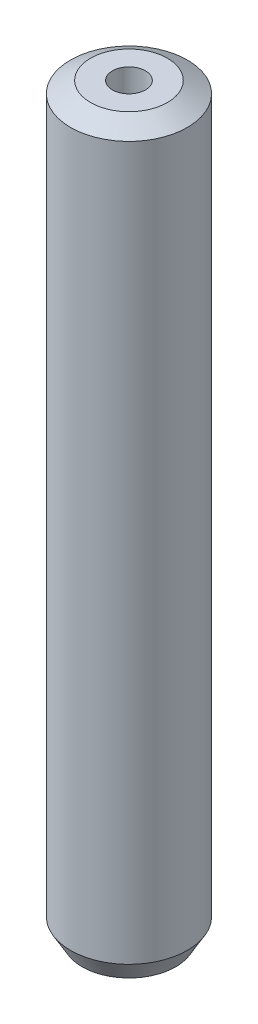
ISO-10303-21;
HEADER;
FILE_DESCRIPTION(('STEP AP214'),'2;1');
FILE_NAME('part.step','',(''),(''),'','','');
FILE_SCHEMA(('AUTOMOTIVE_DESIGN { 1 0 10303 214 1 1 1 1 }'));
ENDSEC;
DATA;
#1=APPLICATION_CONTEXT('core data for automotive mechanical design processes');
#2=APPLICATION_PROTOCOL_DEFINITION('international standard','automotive_design',2000,#1);
#3=PRODUCT_CONTEXT('',#1,'mechanical');
#4=PRODUCT('Part','Part','',(#3));
#5=PRODUCT_RELATED_PRODUCT_CATEGORY('part','',(#4));
#6=PRODUCT_DEFINITION_FORMATION('','',#4);
#7=PRODUCT_DEFINITION_CONTEXT('part definition',#1,'design');
#8=PRODUCT_DEFINITION('design','',#6,#7);
#9=PRODUCT_DEFINITION_SHAPE('','',#8);
#10=(LENGTH_UNIT() NAMED_UNIT(*) SI_UNIT(.MILLI.,.METRE.));
#11=(NAMED_UNIT(*) PLANE_ANGLE_UNIT() SI_UNIT($,.RADIAN.));
#12=(NAMED_UNIT(*) SI_UNIT($,.STERADIAN.) SOLID_ANGLE_UNIT());
#13=UNCERTAINTY_MEASURE_WITH_UNIT(LENGTH_MEASURE(1.E-05),#10,'distance_accuracy_value','');
#14=(GEOMETRIC_REPRESENTATION_CONTEXT(3) GLOBAL_UNCERTAINTY_ASSIGNED_CONTEXT((#13)) GLOBAL_UNIT_ASSIGNED_CONTEXT((#10,
#11,#12)) REPRESENTATION_CONTEXT('',''));
#15=CARTESIAN_POINT('',(0.,0.,0.));
#16=DIRECTION('',(0.,0.,1.));
#17=DIRECTION('',(1.,0.,0.));
#18=AXIS2_PLACEMENT_3D('',#15,#16,#17);
#19=CARTESIAN_POINT('',(0.,191.043298849846,0.));
#20=DIRECTION('',(0.,-1.,0.));
#21=DIRECTION('',(0.,0.,-1.));
#22=AXIS2_PLACEMENT_3D('',#19,#20,#21);
#23=CYLINDRICAL_SURFACE('',#22,15.);
#24=CARTESIAN_POINT('',(0.,188.077368706955,0.));
#25=DIRECTION('',(0.,1.,0.));
#26=DIRECTION('',(0.,0.,1.));
#27=AXIS2_PLACEMENT_3D('',#24,#25,#26);
#28=CIRCLE('',#27,15.);
#29=CARTESIAN_POINT('',(0.,188.077368706955,15.));
#30=VERTEX_POINT('',#29);
#31=EDGE_CURVE('E50',#30,#30,#28,.F.);
#32=ORIENTED_EDGE('',*,*,#31,.T.);
#33=EDGE_LOOP('',(#32));
#34=FACE_BOUND('',#33,.T.);
#35=CARTESIAN_POINT('',(0.,5.13714169918664,0.));
#36=DIRECTION('',(0.,1.,0.));
#37=DIRECTION('',(0.,0.,1.));
#38=AXIS2_PLACEMENT_3D('',#35,#36,#37);
#39=CIRCLE('',#38,15.);
#40=CARTESIAN_POINT('',(0.,5.13714169918664,15.));
#41=VERTEX_POINT('',#40);
#42=EDGE_CURVE('E51',#41,#41,#39,.T.);
#43=ORIENTED_EDGE('',*,*,#42,.T.);
#44=EDGE_LOOP('',(#43));
#45=FACE_BOUND('',#44,.T.);
#46=ADVANCED_FACE('F39',(#34,#45),#23,.T.);
#47=CARTESIAN_POINT('',(0.,191.043298849846,0.));
#48=DIRECTION('',(0.,1.,0.));
#49=DIRECTION('',(0.,0.,1.));
#50=AXIS2_PLACEMENT_3D('',#47,#48,#49);
#51=PLANE('',#50);
#52=CARTESIAN_POINT('',(0.,191.043298849846,0.));
#53=DIRECTION('',(0.,1.,0.));
#54=DIRECTION('',(0.,0.,1.));
#55=AXIS2_PLACEMENT_3D('',#52,#53,#54);
#56=CIRCLE('',#55,9.8628583008133);
#57=CARTESIAN_POINT('',(0.,191.043298849846,9.8628583008133));
#58=VERTEX_POINT('',#57);
#59=EDGE_CURVE('E54',#58,#58,#56,.T.);
#60=ORIENTED_EDGE('',*,*,#59,.T.);
#61=EDGE_LOOP('',(#60));
#62=FACE_BOUND('',#61,.T.);
#63=CARTESIAN_POINT('',(0.,191.043298849846,0.));
#64=DIRECTION('',(0.,1.,0.));
#65=DIRECTION('',(0.,0.,1.));
#66=AXIS2_PLACEMENT_3D('',#63,#64,#65);
#67=CIRCLE('',#66,4.24581836870262);
#68=CARTESIAN_POINT('',(0.,191.043298849846,4.24581836870262));
#69=VERTEX_POINT('',#68);
#70=EDGE_CURVE('E58',#69,#69,#67,.T.);
#71=ORIENTED_EDGE('',*,*,#70,.F.);
#72=EDGE_LOOP('',(#71));
#73=FACE_BOUND('',#72,.T.);
#74=ADVANCED_FACE('F69',(#62,#73),#51,.T.);
#75=CARTESIAN_POINT('',(0.,0.,0.));
#76=DIRECTION('',(0.,1.,0.));
#77=DIRECTION('',(0.,0.,1.));
#78=AXIS2_PLACEMENT_3D('',#75,#76,#77);
#79=PLANE('',#78);
#80=CARTESIAN_POINT('',(0.,0.,0.));
#81=DIRECTION('',(0.,1.,0.));
#82=DIRECTION('',(0.,0.,1.));
#83=AXIS2_PLACEMENT_3D('',#80,#81,#82);
#84=CIRCLE('',#83,12.0340698571093);
#85=CARTESIAN_POINT('',(0.,0.,12.0340698571093));
#86=VERTEX_POINT('',#85);
#87=EDGE_CURVE('E10',#86,#86,#84,.F.);
#88=ORIENTED_EDGE('',*,*,#87,.T.);
#89=EDGE_LOOP('',(#88));
#90=FACE_BOUND('',#89,.T.);
#91=CARTESIAN_POINT('',(0.,0.,0.));
#92=DIRECTION('',(0.,1.,0.));
#93=DIRECTION('',(0.,0.,1.));
#94=AXIS2_PLACEMENT_3D('',#91,#92,#93);
#95=CIRCLE('',#94,4.24581836870262);
#96=CARTESIAN_POINT('',(0.,0.,4.24581836870262));
#97=VERTEX_POINT('',#96);
#98=EDGE_CURVE('E63',#97,#97,#95,.T.);
#99=ORIENTED_EDGE('',*,*,#98,.T.);
#100=EDGE_LOOP('',(#99));
#101=FACE_BOUND('',#100,.T.);
#102=ADVANCED_FACE('F75',(#90,#101),#79,.F.);
#103=CARTESIAN_POINT('',(0.,191.043298849846,0.));
#104=DIRECTION('',(0.,-1.,0.));
#105=DIRECTION('',(0.,0.,-1.));
#106=AXIS2_PLACEMENT_3D('',#103,#104,#105);
#107=CYLINDRICAL_SURFACE('',#106,4.24581836870262);
#108=ORIENTED_EDGE('',*,*,#70,.T.);
#109=EDGE_LOOP('',(#108));
#110=FACE_BOUND('',#109,.T.);
#111=ORIENTED_EDGE('',*,*,#98,.F.);
#112=EDGE_LOOP('',(#111));
#113=FACE_BOUND('',#112,.T.);
#114=ADVANCED_FACE('F70',(#110,#113),#107,.F.);
#115=CARTESIAN_POINT('',(0.,191.043298849846,0.));
#116=DIRECTION('',(0.,-1.,0.));
#117=DIRECTION('',(0.,0.,-1.));
#118=AXIS2_PLACEMENT_3D('',#115,#116,#117);
#119=CONICAL_SURFACE('',#118,9.8628583008133,1.0471975511966);
#120=ORIENTED_EDGE('',*,*,#31,.F.);
#121=EDGE_LOOP('',(#120));
#122=FACE_BOUND('',#121,.T.);
#123=ORIENTED_EDGE('',*,*,#59,.F.);
#124=EDGE_LOOP('',(#123));
#125=FACE_BOUND('',#124,.T.);
#126=ADVANCED_FACE('F81',(#122,#125),#119,.T.);
#127=CARTESIAN_POINT('',(0.,5.13714169918664,0.));
#128=DIRECTION('',(0.,1.,0.));
#129=DIRECTION('',(0.,0.,1.));
#130=AXIS2_PLACEMENT_3D('',#127,#128,#129);
#131=CONICAL_SURFACE('',#130,15.,0.523598775598302);
#132=CARTESIAN_POINT('',(0.,0.,12.0340698571093));
#133=CARTESIAN_POINT('',(0.,0.0535118926998599,12.0649649627644));
#134=CARTESIAN_POINT('',(0.,0.107023785399721,12.0958600684195));
#135=CARTESIAN_POINT('',(0.,0.214047570799442,12.1576502797298));
#136=CARTESIAN_POINT('',(0.,0.267559463499303,12.1885453853849));
#137=CARTESIAN_POINT('',(0.,0.374583248899025,12.2503355966951));
#138=CARTESIAN_POINT('',(0.,0.428095141598886,12.2812307023502));
#139=CARTESIAN_POINT('',(0.,0.535118926998607,12.3430209136604));
#140=CARTESIAN_POINT('',(0.,0.588630819698468,12.3739160193155));
#141=CARTESIAN_POINT('',(0.,0.695654605098189,12.4357062306258));
#142=CARTESIAN_POINT('',(0.,0.74916649779805,12.4666013362809));
#143=CARTESIAN_POINT('',(0.,0.856190283197772,12.5283915475911));
#144=CARTESIAN_POINT('',(0.,0.909702175897633,12.5592866532462));
#145=CARTESIAN_POINT('',(0.,1.01672596129735,12.6210768645564));
#146=CARTESIAN_POINT('',(0.,1.07023785399722,12.6519719702115));
#147=CARTESIAN_POINT('',(0.,1.17726163939694,12.7137621815218));
#148=CARTESIAN_POINT('',(0.,1.2307735320968,12.7446572871769));
#149=CARTESIAN_POINT('',(0.,1.33779731749652,12.8064474984871));
#150=CARTESIAN_POINT('',(0.,1.39130921019638,12.8373426041422));
#151=CARTESIAN_POINT('',(0.,1.4983329955961,12.8991328154524));
#152=CARTESIAN_POINT('',(0.,1.55184488829596,12.9300279211075));
#153=CARTESIAN_POINT('',(0.,1.65886867369568,12.9918181324178));
#154=CARTESIAN_POINT('',(0.,1.71238056639554,13.0227132380729));
#155=CARTESIAN_POINT('',(0.,1.81940435179527,13.0845034493831));
#156=CARTESIAN_POINT('',(0.,1.87291624449513,13.1153985550382));
#157=CARTESIAN_POINT('',(0.,1.97994002989485,13.1771887663484));
#158=CARTESIAN_POINT('',(0.,2.03345192259471,13.2080838720035));
#159=CARTESIAN_POINT('',(0.,2.14047570799443,13.2698740833138));
#160=CARTESIAN_POINT('',(0.,2.19398760069429,13.3007691889689));
#161=CARTESIAN_POINT('',(0.,2.30101138609401,13.3625594002791));
#162=CARTESIAN_POINT('',(0.,2.35452327879387,13.3934545059342));
#163=CARTESIAN_POINT('',(0.,2.4615470641936,13.4552447172444));
#164=CARTESIAN_POINT('',(0.,2.51505895689346,13.4861398228996));
#165=CARTESIAN_POINT('',(0.,2.62208274229318,13.5479300342098));
#166=CARTESIAN_POINT('',(0.,2.67559463499304,13.5788251398649));
#167=CARTESIAN_POINT('',(0.,2.78261842039276,13.6406153511751));
#168=CARTESIAN_POINT('',(0.,2.83613031309262,13.6715104568302));
#169=CARTESIAN_POINT('',(0.,2.94315409849234,13.7333006681404));
#170=CARTESIAN_POINT('',(0.,2.9966659911922,13.7641957737955));
#171=CARTESIAN_POINT('',(0.,3.10368977659193,13.8259859851058));
#172=CARTESIAN_POINT('',(0.,3.15720166929179,13.8568810907609));
#173=CARTESIAN_POINT('',(0.,3.26422545469151,13.9186713020711));
#174=CARTESIAN_POINT('',(0.,3.31773734739137,13.9495664077262));
#175=CARTESIAN_POINT('',(0.,3.42476113279109,14.0113566190364));
#176=CARTESIAN_POINT('',(0.,3.47827302549095,14.0422517246916));
#177=CARTESIAN_POINT('',(0.,3.58529681089067,14.1040419360018));
#178=CARTESIAN_POINT('',(0.,3.63880870359053,14.1349370416569));
#179=CARTESIAN_POINT('',(0.,3.74583248899026,14.1967272529671));
#180=CARTESIAN_POINT('',(0.,3.79934438169012,14.2276223586222));
#181=CARTESIAN_POINT('',(0.,3.90636816708984,14.2894125699324));
#182=CARTESIAN_POINT('',(0.,3.9598800597897,14.3203076755876));
#183=CARTESIAN_POINT('',(0.,4.06690384518942,14.3820978868978));
#184=CARTESIAN_POINT('',(0.,4.12041573788928,14.4129929925529));
#185=CARTESIAN_POINT('',(0.,4.227439523289,14.4747832038631));
#186=CARTESIAN_POINT('',(0.,4.28095141598886,14.5056783095182));
#187=CARTESIAN_POINT('',(0.,4.38797520138858,14.5674685208284));
#188=CARTESIAN_POINT('',(0.,4.44148709408844,14.5983636264836));
#189=CARTESIAN_POINT('',(0.,4.54851087948817,14.6601538377938));
#190=CARTESIAN_POINT('',(0.,4.60202277218803,14.6910489434489));
#191=CARTESIAN_POINT('',(0.,4.70904655758775,14.7528391547591));
#192=CARTESIAN_POINT('',(0.,4.76255845028761,14.7837342604142));
#193=CARTESIAN_POINT('',(0.,4.86958223568733,14.8455244717244));
#194=CARTESIAN_POINT('',(0.,4.92309412838719,14.8764195773796));
#195=CARTESIAN_POINT('',(0.,5.03011791378692,14.9382097886898));
#196=CARTESIAN_POINT('',(0.,5.08362980648678,14.9691048943449));
#197=CARTESIAN_POINT('',(0.,5.13714169918664,15.));
#198=B_SPLINE_CURVE_WITH_KNOTS('',3,(#132,#133,#134,#135,#136,#137,#138,#139,#140,#141,#142,
#143,#144,#145,#146,#147,#148,#149,#150,#151,#152,#153,#154,#155,#156,#157,#158,#159,#160,#161,
#162,#163,#164,#165,#166,#167,#168,#169,#170,#171,#172,#173,#174,#175,#176,#177,#178,#179,#180,
#181,#182,#183,#184,#185,#186,#187,#188,#189,#190,#191,#192,#193,#194,#195,#196,#197),
.UNSPECIFIED.,.F.,.F.,(4,2,2,2,2,2,2,2,2,2,2,2,2,2,2,2,2,2,2,2,2,2,2,2,2,2,2,2,2,2,2,2,4),(0.,
0.185370633930666,0.370741267861332,0.556111901791999,0.741482535722665,0.926853169653331,
1.112223803584,1.29759443751466,1.48296507144533,1.668335705376,1.85370633930666,
2.03907697323733,2.224447607168,2.40981824109866,2.59518887502933,2.78055950896,
2.96593014289066,3.15130077682133,3.336671410752,3.52204204468266,3.70741267861333,
3.89278331254399,4.07815394647466,4.26352458040533,4.44889521433599,4.63426584826666,
4.81963648219732,5.00500711612799,5.19037775005866,5.37574838398932,5.56111901791999,
5.74648965185065,5.93186028578132),.UNSPECIFIED.);
#199=EDGE_CURVE('BSEAM45',#86,#41,#198,.T.);
#200=ORIENTED_EDGE('',*,*,#87,.F.);
#201=ORIENTED_EDGE('',*,*,#42,.F.);
#202=ORIENTED_EDGE('',*,*,#199,.T.);
#203=ORIENTED_EDGE('',*,*,#199,.F.);
#204=EDGE_LOOP('',(#200,#202,#201,#203));
#205=FACE_BOUND('',#204,.T.);
#206=ADVANCED_FACE('F45',(#205),#131,.T.);
#207=CLOSED_SHELL('',(#46,#74,#102,#114,#126,#206));
#208=MANIFOLD_SOLID_BREP('B2',#207);
#209=ADVANCED_BREP_SHAPE_REPRESENTATION('',(#18,#208),#14);
#210=SHAPE_DEFINITION_REPRESENTATION(#9,#209);
ENDSEC;
END-ISO-10303-21;
